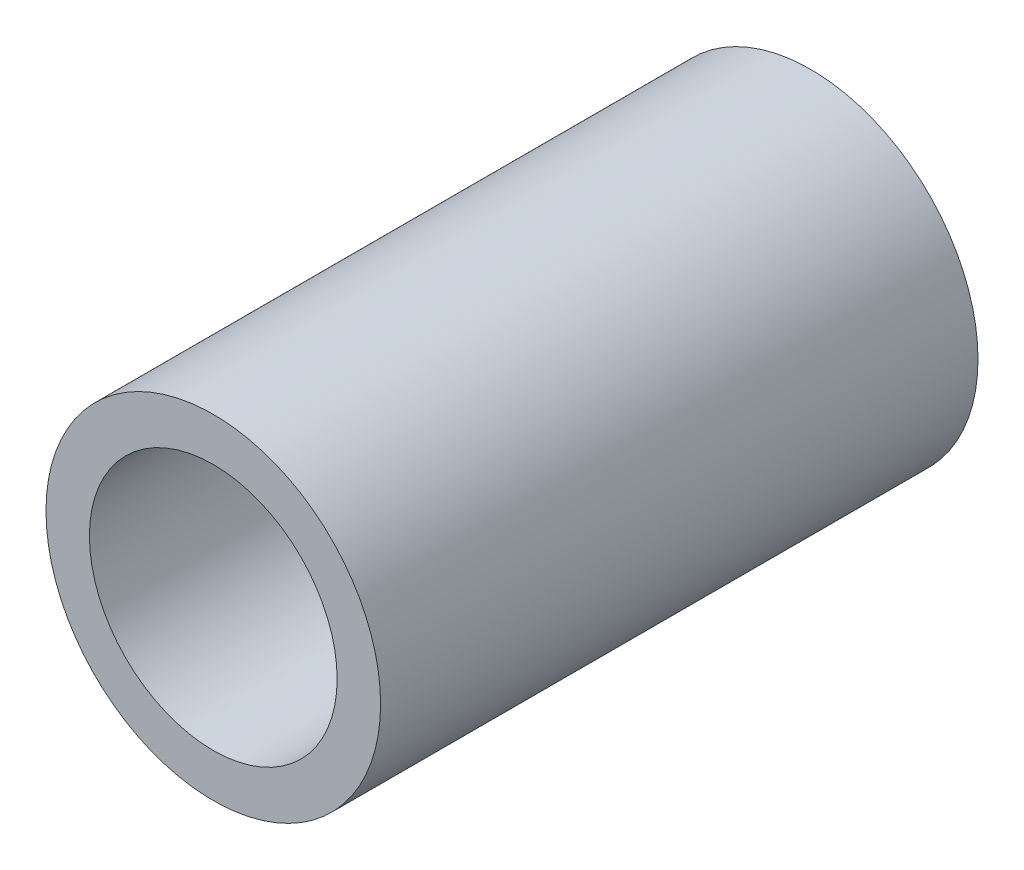
ISO-10303-21;
HEADER;
FILE_DESCRIPTION(('STEP AP214'),'2;1');
FILE_NAME('part.step','',(''),(''),'','','');
FILE_SCHEMA(('AUTOMOTIVE_DESIGN { 1 0 10303 214 1 1 1 1 }'));
ENDSEC;
DATA;
#1=APPLICATION_CONTEXT('core data for automotive mechanical design processes');
#2=APPLICATION_PROTOCOL_DEFINITION('international standard','automotive_design',2000,#1);
#3=PRODUCT_CONTEXT('',#1,'mechanical');
#4=PRODUCT('Part','Part','',(#3));
#5=PRODUCT_RELATED_PRODUCT_CATEGORY('part','',(#4));
#6=PRODUCT_DEFINITION_FORMATION('','',#4);
#7=PRODUCT_DEFINITION_CONTEXT('part definition',#1,'design');
#8=PRODUCT_DEFINITION('design','',#6,#7);
#9=PRODUCT_DEFINITION_SHAPE('','',#8);
#10=(LENGTH_UNIT() NAMED_UNIT(*) SI_UNIT(.MILLI.,.METRE.));
#11=(NAMED_UNIT(*) PLANE_ANGLE_UNIT() SI_UNIT($,.RADIAN.));
#12=(NAMED_UNIT(*) SI_UNIT($,.STERADIAN.) SOLID_ANGLE_UNIT());
#13=UNCERTAINTY_MEASURE_WITH_UNIT(LENGTH_MEASURE(1.E-05),#10,'distance_accuracy_value','');
#14=(GEOMETRIC_REPRESENTATION_CONTEXT(3) GLOBAL_UNCERTAINTY_ASSIGNED_CONTEXT((#13)) GLOBAL_UNIT_ASSIGNED_CONTEXT((#10,
#11,#12)) REPRESENTATION_CONTEXT('',''));
#15=CARTESIAN_POINT('',(0.,0.,0.));
#16=DIRECTION('',(0.,0.,1.));
#17=DIRECTION('',(1.,0.,0.));
#18=AXIS2_PLACEMENT_3D('',#15,#16,#17);
#19=CARTESIAN_POINT('',(0.,0.,19.05));
#20=DIRECTION('',(0.,0.,1.));
#21=DIRECTION('',(1.,0.,0.));
#22=AXIS2_PLACEMENT_3D('',#19,#20,#21);
#23=PLANE('',#22);
#24=CARTESIAN_POINT('',(0.,0.,19.05));
#25=DIRECTION('',(0.,0.,1.));
#26=DIRECTION('',(1.,0.,0.));
#27=AXIS2_PLACEMENT_3D('',#24,#25,#26);
#28=CIRCLE('',#27,10.668);
#29=CARTESIAN_POINT('',(10.668,0.,19.05));
#30=VERTEX_POINT('',#29);
#31=EDGE_CURVE('E11',#30,#30,#28,.T.);
#32=ORIENTED_EDGE('',*,*,#31,.T.);
#33=EDGE_LOOP('',(#32));
#34=FACE_BOUND('',#33,.T.);
#35=CARTESIAN_POINT('',(0.,0.,19.05));
#36=DIRECTION('',(0.,0.,1.));
#37=DIRECTION('',(1.,0.,0.));
#38=AXIS2_PLACEMENT_3D('',#35,#36,#37);
#39=CIRCLE('',#38,7.8994);
#40=CARTESIAN_POINT('',(7.8994,0.,19.05));
#41=VERTEX_POINT('',#40);
#42=EDGE_CURVE('E50',#41,#41,#39,.T.);
#43=ORIENTED_EDGE('',*,*,#42,.F.);
#44=EDGE_LOOP('',(#43));
#45=FACE_BOUND('',#44,.T.);
#46=ADVANCED_FACE('F39',(#34,#45),#23,.T.);
#47=CARTESIAN_POINT('',(0.,0.,-19.05));
#48=DIRECTION('',(0.,0.,1.));
#49=DIRECTION('',(1.,0.,0.));
#50=AXIS2_PLACEMENT_3D('',#47,#48,#49);
#51=PLANE('',#50);
#52=CARTESIAN_POINT('',(0.,0.,-19.05));
#53=DIRECTION('',(0.,0.,1.));
#54=DIRECTION('',(1.,0.,0.));
#55=AXIS2_PLACEMENT_3D('',#52,#53,#54);
#56=CIRCLE('',#55,10.668);
#57=CARTESIAN_POINT('',(10.668,0.,-19.05));
#58=VERTEX_POINT('',#57);
#59=EDGE_CURVE('E43',#58,#58,#56,.T.);
#60=ORIENTED_EDGE('',*,*,#59,.F.);
#61=EDGE_LOOP('',(#60));
#62=FACE_BOUND('',#61,.T.);
#63=CARTESIAN_POINT('',(0.,0.,-19.05));
#64=DIRECTION('',(0.,0.,1.));
#65=DIRECTION('',(1.,0.,0.));
#66=AXIS2_PLACEMENT_3D('',#63,#64,#65);
#67=CIRCLE('',#66,7.8994);
#68=CARTESIAN_POINT('',(7.8994,0.,-19.05));
#69=VERTEX_POINT('',#68);
#70=EDGE_CURVE('E52',#69,#69,#67,.T.);
#71=ORIENTED_EDGE('',*,*,#70,.T.);
#72=EDGE_LOOP('',(#71));
#73=FACE_BOUND('',#72,.T.);
#74=ADVANCED_FACE('F62',(#62,#73),#51,.F.);
#75=CARTESIAN_POINT('',(0.,0.,19.05));
#76=DIRECTION('',(0.,0.,-1.));
#77=DIRECTION('',(-1.,0.,0.));
#78=AXIS2_PLACEMENT_3D('',#75,#76,#77);
#79=CYLINDRICAL_SURFACE('',#78,10.668);
#80=ORIENTED_EDGE('',*,*,#31,.F.);
#81=EDGE_LOOP('',(#80));
#82=FACE_BOUND('',#81,.T.);
#83=ORIENTED_EDGE('',*,*,#59,.T.);
#84=EDGE_LOOP('',(#83));
#85=FACE_BOUND('',#84,.T.);
#86=ADVANCED_FACE('F41',(#82,#85),#79,.T.);
#87=CARTESIAN_POINT('',(0.,0.,19.05));
#88=DIRECTION('',(0.,0.,-1.));
#89=DIRECTION('',(-1.,0.,0.));
#90=AXIS2_PLACEMENT_3D('',#87,#88,#89);
#91=CYLINDRICAL_SURFACE('',#90,7.8994);
#92=ORIENTED_EDGE('',*,*,#42,.T.);
#93=EDGE_LOOP('',(#92));
#94=FACE_BOUND('',#93,.T.);
#95=ORIENTED_EDGE('',*,*,#70,.F.);
#96=EDGE_LOOP('',(#95));
#97=FACE_BOUND('',#96,.T.);
#98=ADVANCED_FACE('F58',(#94,#97),#91,.F.);
#99=CLOSED_SHELL('',(#46,#74,#86,#98));
#100=MANIFOLD_SOLID_BREP('B2',#99);
#101=ADVANCED_BREP_SHAPE_REPRESENTATION('',(#18,#100),#14);
#102=SHAPE_DEFINITION_REPRESENTATION(#9,#101);
ENDSEC;
END-ISO-10303-21;
